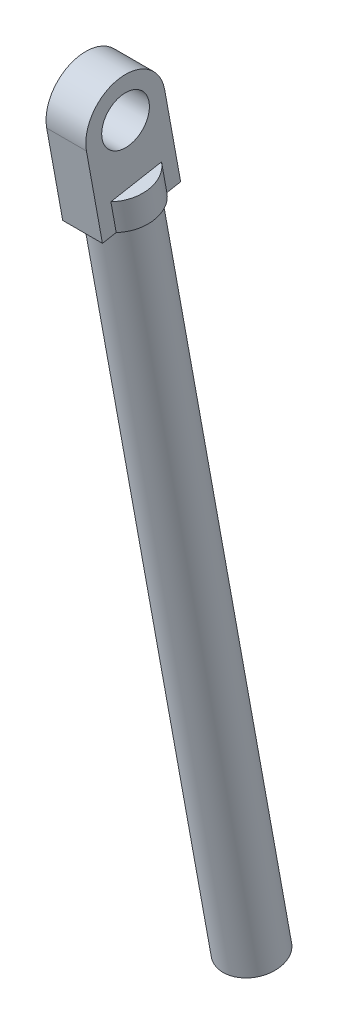
ISO-10303-21;
HEADER;
FILE_DESCRIPTION(('STEP AP214'),'2;1');
FILE_NAME('part.step','',(''),(''),'','','');
FILE_SCHEMA(('AUTOMOTIVE_DESIGN { 1 0 10303 214 1 1 1 1 }'));
ENDSEC;
DATA;
#1=APPLICATION_CONTEXT('core data for automotive mechanical design processes');
#2=APPLICATION_PROTOCOL_DEFINITION('international standard','automotive_design',2000,#1);
#3=PRODUCT_CONTEXT('',#1,'mechanical');
#4=PRODUCT('Part','Part','',(#3));
#5=PRODUCT_RELATED_PRODUCT_CATEGORY('part','',(#4));
#6=PRODUCT_DEFINITION_FORMATION('','',#4);
#7=PRODUCT_DEFINITION_CONTEXT('part definition',#1,'design');
#8=PRODUCT_DEFINITION('design','',#6,#7);
#9=PRODUCT_DEFINITION_SHAPE('','',#8);
#10=(LENGTH_UNIT() NAMED_UNIT(*) SI_UNIT(.MILLI.,.METRE.));
#11=(NAMED_UNIT(*) PLANE_ANGLE_UNIT() SI_UNIT($,.RADIAN.));
#12=(NAMED_UNIT(*) SI_UNIT($,.STERADIAN.) SOLID_ANGLE_UNIT());
#13=UNCERTAINTY_MEASURE_WITH_UNIT(LENGTH_MEASURE(1.E-05),#10,'distance_accuracy_value','');
#14=(GEOMETRIC_REPRESENTATION_CONTEXT(3) GLOBAL_UNCERTAINTY_ASSIGNED_CONTEXT((#13)) GLOBAL_UNIT_ASSIGNED_CONTEXT((#10,
#11,#12)) REPRESENTATION_CONTEXT('',''));
#15=CARTESIAN_POINT('',(0.,0.,0.));
#16=DIRECTION('',(0.,0.,1.));
#17=DIRECTION('',(1.,0.,0.));
#18=AXIS2_PLACEMENT_3D('',#15,#16,#17);
#19=CARTESIAN_POINT('',(2450.0000000001,1602.21552230463,443.812235803623));
#20=DIRECTION('',(0.,-0.983852787309741,-0.178979587950285));
#21=DIRECTION('',(-1.,0.,0.));
#22=AXIS2_PLACEMENT_3D('',#19,#20,#21);
#23=PLANE('',#22);
#24=DIRECTION('',(0.,0.178979587950285,-0.983852787309741));
#25=VECTOR('',#24,1.);
#26=CARTESIAN_POINT('',(2500.00000000005,1602.21552230463,443.812235803623));
#27=LINE('',#26,#25);
#28=CARTESIAN_POINT('',(2500.00000000005,1613.80339130362,380.113590923445));
#29=VERTEX_POINT('',#28);
#30=CARTESIAN_POINT('',(2500.00000000005,1590.62765330563,507.510880683802));
#31=VERTEX_POINT('',#30);
#32=EDGE_CURVE('E74',#29,#31,#27,.F.);
#33=ORIENTED_EDGE('',*,*,#32,.T.);
#34=CARTESIAN_POINT('',(2450.0000000001,1602.21552230463,443.812235803623));
#35=DIRECTION('',(0.,-0.983852787309741,-0.178979587950285));
#36=DIRECTION('',(-1.,0.,0.));
#37=AXIS2_PLACEMENT_3D('',#34,#35,#36);
#38=CIRCLE('',#37,81.8033988750113);
#39=EDGE_CURVE('E19',#29,#31,#38,.T.);
#40=ORIENTED_EDGE('',*,*,#39,.F.);
#41=EDGE_LOOP('',(#33,#40));
#42=FACE_BOUND('',#41,.T.);
#43=ADVANCED_FACE('F16',(#42),#23,.F.);
#44=CARTESIAN_POINT('',(2400.00000000005,1749.7934404011,470.659173996167));
#45=DIRECTION('',(-1.,0.,0.));
#46=DIRECTION('',(0.,0.983852787309741,0.178979587950285));
#47=AXIS2_PLACEMENT_3D('',#44,#45,#46);
#48=CYLINDRICAL_SURFACE('',#47,60.0000000000005);
#49=CARTESIAN_POINT('',(2400.00000000005,1749.7934404011,470.659173996167));
#50=DIRECTION('',(-1.,0.,0.));
#51=DIRECTION('',(0.,0.983852787309741,0.178979587950285));
#52=AXIS2_PLACEMENT_3D('',#49,#50,#51);
#53=CIRCLE('',#52,60.0000000000005);
#54=CARTESIAN_POINT('',(2400.00000000005,1808.82460763968,481.397949273184));
#55=VERTEX_POINT('',#54);
#56=EDGE_CURVE('E118',#55,#55,#53,.F.);
#57=ORIENTED_EDGE('',*,*,#56,.F.);
#58=EDGE_LOOP('',(#57));
#59=FACE_BOUND('',#58,.T.);
#60=CARTESIAN_POINT('',(2500.00000000005,1749.7934404011,470.659173996168));
#61=DIRECTION('',(-1.,0.,0.));
#62=DIRECTION('',(0.,0.983852787309741,0.178979587950285));
#63=AXIS2_PLACEMENT_3D('',#60,#61,#62);
#64=CIRCLE('',#63,60.0000000000005);
#65=CARTESIAN_POINT('',(2500.00000000005,1808.82460763968,481.397949273185));
#66=VERTEX_POINT('',#65);
#67=EDGE_CURVE('E77',#66,#66,#64,.F.);
#68=ORIENTED_EDGE('',*,*,#67,.T.);
#69=EDGE_LOOP('',(#68));
#70=FACE_BOUND('',#69,.T.);
#71=ADVANCED_FACE('F201',(#59,#70),#48,.F.);
#72=CARTESIAN_POINT('',(2500.00000000005,1749.7934404011,470.659173996168));
#73=DIRECTION('',(-1.,0.,0.));
#74=DIRECTION('',(0.,0.983852787309741,0.178979587950285));
#75=AXIS2_PLACEMENT_3D('',#72,#73,#74);
#76=CYLINDRICAL_SURFACE('',#75,99.9999999999996);
#77=DIRECTION('',(1.,0.,0.));
#78=VECTOR('',#77,1.);
#79=CARTESIAN_POINT('',(2500.00000000005,1767.69139919613,372.273895265193));
#80=LINE('',#79,#78);
#81=CARTESIAN_POINT('',(2400.00000000005,1767.69139919613,372.273895265192));
#82=VERTEX_POINT('',#81);
#83=CARTESIAN_POINT('',(2500.00000000005,1767.69139919613,372.273895265193));
#84=VERTEX_POINT('',#83);
#85=EDGE_CURVE('E78',#82,#84,#80,.T.);
#86=ORIENTED_EDGE('',*,*,#85,.F.);
#87=CARTESIAN_POINT('',(2400.00000000005,1749.7934404011,470.659173996167));
#88=DIRECTION('',(-1.,0.,0.));
#89=DIRECTION('',(0.,0.983852787309741,0.178979587950285));
#90=AXIS2_PLACEMENT_3D('',#87,#88,#89);
#91=CIRCLE('',#90,99.9999999999996);
#92=CARTESIAN_POINT('',(2400.00000000005,1731.89548160607,569.044452727141));
#93=VERTEX_POINT('',#92);
#94=EDGE_CURVE('E113',#93,#82,#91,.T.);
#95=ORIENTED_EDGE('',*,*,#94,.F.);
#96=DIRECTION('',(1.,0.,0.));
#97=VECTOR('',#96,1.);
#98=CARTESIAN_POINT('',(2500.00000000005,1731.89548160607,569.044452727142));
#99=LINE('',#98,#97);
#100=CARTESIAN_POINT('',(2500.00000000005,1731.89548160607,569.044452727142));
#101=VERTEX_POINT('',#100);
#102=EDGE_CURVE('E96',#101,#93,#99,.F.);
#103=ORIENTED_EDGE('',*,*,#102,.F.);
#104=CARTESIAN_POINT('',(2500.00000000005,1749.7934404011,470.659173996168));
#105=DIRECTION('',(-1.,0.,0.));
#106=DIRECTION('',(0.,0.983852787309741,0.178979587950285));
#107=AXIS2_PLACEMENT_3D('',#104,#105,#106);
#108=CIRCLE('',#107,99.9999999999996);
#109=EDGE_CURVE('E122',#101,#84,#108,.T.);
#110=ORIENTED_EDGE('',*,*,#109,.T.);
#111=EDGE_LOOP('',(#86,#95,#103,#110));
#112=FACE_BOUND('',#111,.T.);
#113=ADVANCED_FACE('F199',(#112),#76,.T.);
#114=CARTESIAN_POINT('',(2450.0000000001,1602.21552230463,443.812235803623));
#115=DIRECTION('',(0.,-0.983852787309741,-0.178979587950285));
#116=DIRECTION('',(-1.,0.,0.));
#117=AXIS2_PLACEMENT_3D('',#114,#115,#116);
#118=PLANE('',#117);
#119=DIRECTION('',(0.,0.178979587950285,-0.983852787309741));
#120=VECTOR('',#119,1.);
#121=CARTESIAN_POINT('',(2400.00000000005,1602.21552230463,443.812235803623));
#122=LINE('',#121,#120);
#123=CARTESIAN_POINT('',(2400.00000000005,1613.80339130361,380.113590923518));
#124=VERTEX_POINT('',#123);
#125=CARTESIAN_POINT('',(2400.00000000005,1590.62765330564,507.510880683728));
#126=VERTEX_POINT('',#125);
#127=EDGE_CURVE('E121',#124,#126,#122,.F.);
#128=ORIENTED_EDGE('',*,*,#127,.F.);
#129=CARTESIAN_POINT('',(2450.0000000001,1602.21552230463,443.812235803623));
#130=DIRECTION('',(0.,-0.983852787309741,-0.178979587950285));
#131=DIRECTION('',(-1.,0.,0.));
#132=AXIS2_PLACEMENT_3D('',#129,#130,#131);
#133=CIRCLE('',#132,81.8033988750117);
#134=EDGE_CURVE('E108',#126,#124,#133,.T.);
#135=ORIENTED_EDGE('',*,*,#134,.F.);
#136=EDGE_LOOP('',(#128,#135));
#137=FACE_BOUND('',#136,.T.);
#138=ADVANCED_FACE('F191',(#137),#118,.F.);
#139=CARTESIAN_POINT('',(2500.00000000005,1767.69139919613,372.273895265193));
#140=DIRECTION('',(0.,0.178979587950285,-0.983852787309741));
#141=DIRECTION('',(0.,0.983852787309741,0.178979587950285));
#142=AXIS2_PLACEMENT_3D('',#139,#140,#141);
#143=PLANE('',#142);
#144=DIRECTION('',(0.,0.983852787309741,0.178979587950285));
#145=VECTOR('',#144,1.);
#146=CARTESIAN_POINT('',(2500.00000000005,1767.69139919613,372.273895265193));
#147=LINE('',#146,#145);
#148=CARTESIAN_POINT('',(2500.00000000005,1546.32452205142,332.003487976377));
#149=VERTEX_POINT('',#148);
#150=EDGE_CURVE('E87',#84,#149,#147,.F.);
#151=ORIENTED_EDGE('',*,*,#150,.T.);
#152=DIRECTION('',(-1.,0.,0.));
#153=VECTOR('',#152,1.);
#154=CARTESIAN_POINT('',(2500.00000000005,1546.32452205142,332.003487976377));
#155=LINE('',#154,#153);
#156=CARTESIAN_POINT('',(2400.00000000005,1546.32452205142,332.003487976376));
#157=VERTEX_POINT('',#156);
#158=EDGE_CURVE('E131',#157,#149,#155,.F.);
#159=ORIENTED_EDGE('',*,*,#158,.F.);
#160=DIRECTION('',(0.,0.983852787309741,0.178979587950285));
#161=VECTOR('',#160,1.);
#162=CARTESIAN_POINT('',(2400.00000000005,1767.69139919613,372.273895265192));
#163=LINE('',#162,#161);
#164=EDGE_CURVE('E116',#82,#157,#163,.F.);
#165=ORIENTED_EDGE('',*,*,#164,.F.);
#166=ORIENTED_EDGE('',*,*,#85,.T.);
#167=EDGE_LOOP('',(#151,#159,#165,#166));
#168=FACE_BOUND('',#167,.T.);
#169=ADVANCED_FACE('F143',(#168),#143,.T.);
#170=CARTESIAN_POINT('',(2450.0000000001,1602.21552230463,443.812235803623));
#171=DIRECTION('',(0.,-0.983852787309741,-0.178979587950285));
#172=DIRECTION('',(-1.,0.,0.));
#173=AXIS2_PLACEMENT_3D('',#170,#171,#172);
#174=CYLINDRICAL_SURFACE('',#173,81.8033988750113);
#175=ORIENTED_EDGE('',*,*,#39,.T.);
#176=DIRECTION('',(0.,0.983852787309741,0.178979587950285));
#177=VECTOR('',#176,1.);
#178=CARTESIAN_POINT('',(2500.00000000005,1738.2055714021,534.357818876346));
#179=LINE('',#178,#177);
#180=CARTESIAN_POINT('',(2500.00000000005,1516.8386942574,494.08741158753));
#181=VERTEX_POINT('',#180);
#182=EDGE_CURVE('E92',#31,#181,#179,.F.);
#183=ORIENTED_EDGE('',*,*,#182,.T.);
#184=CARTESIAN_POINT('',(2450.0000000001,1528.42656325639,430.388766707352));
#185=DIRECTION('',(0.,-0.983852787309741,-0.178979587950285));
#186=DIRECTION('',(-1.,0.,0.));
#187=AXIS2_PLACEMENT_3D('',#184,#185,#186);
#188=CIRCLE('',#187,81.8033988750113);
#189=CARTESIAN_POINT('',(2500.00000000005,1540.01443225539,366.690121827173));
#190=VERTEX_POINT('',#189);
#191=EDGE_CURVE('E83',#190,#181,#188,.T.);
#192=ORIENTED_EDGE('',*,*,#191,.F.);
#193=DIRECTION('',(0.,0.983852787309741,0.178979587950285));
#194=VECTOR('',#193,1.);
#195=CARTESIAN_POINT('',(2500.00000000005,1761.3813094001,406.960529115989));
#196=LINE('',#195,#194);
#197=EDGE_CURVE('E80',#190,#29,#196,.T.);
#198=ORIENTED_EDGE('',*,*,#197,.T.);
#199=EDGE_LOOP('',(#175,#183,#192,#198));
#200=FACE_BOUND('',#199,.T.);
#201=ADVANCED_FACE('F81',(#200),#174,.T.);
#202=CARTESIAN_POINT('',(2500.00000000005,1749.7934404011,470.659173996168));
#203=DIRECTION('',(-1.,0.,0.));
#204=DIRECTION('',(0.,0.983852787309741,0.178979587950285));
#205=AXIS2_PLACEMENT_3D('',#202,#203,#204);
#206=PLANE('',#205);
#207=ORIENTED_EDGE('',*,*,#197,.F.);
#208=DIRECTION('',(0.,0.178979587950285,-0.983852787309741));
#209=VECTOR('',#208,1.);
#210=CARTESIAN_POINT('',(2500.00000000005,1546.32452205142,332.003487976377));
#211=LINE('',#210,#209);
#212=EDGE_CURVE('E107',#149,#190,#211,.F.);
#213=ORIENTED_EDGE('',*,*,#212,.F.);
#214=ORIENTED_EDGE('',*,*,#150,.F.);
#215=ORIENTED_EDGE('',*,*,#109,.F.);
#216=DIRECTION('',(0.,-0.983852787309741,-0.178979587950285));
#217=VECTOR('',#216,1.);
#218=CARTESIAN_POINT('',(2500.00000000005,1510.52860446137,528.774045438326));
#219=LINE('',#218,#217);
#220=CARTESIAN_POINT('',(2500.00000000005,1510.52860446137,528.774045438326));
#221=VERTEX_POINT('',#220);
#222=EDGE_CURVE('E93',#221,#101,#219,.F.);
#223=ORIENTED_EDGE('',*,*,#222,.F.);
#224=DIRECTION('',(0.,0.178979587950285,-0.983852787309741));
#225=VECTOR('',#224,1.);
#226=CARTESIAN_POINT('',(2500.00000000005,1546.32452205142,332.003487976377));
#227=LINE('',#226,#225);
#228=EDGE_CURVE('E106',#181,#221,#227,.F.);
#229=ORIENTED_EDGE('',*,*,#228,.F.);
#230=ORIENTED_EDGE('',*,*,#182,.F.);
#231=ORIENTED_EDGE('',*,*,#32,.F.);
#232=EDGE_LOOP('',(#207,#213,#214,#215,#223,#229,#230,#231));
#233=FACE_BOUND('',#232,.T.);
#234=ORIENTED_EDGE('',*,*,#67,.F.);
#235=EDGE_LOOP('',(#234));
#236=FACE_BOUND('',#235,.T.);
#237=ADVANCED_FACE('F89',(#233,#236),#206,.F.);
#238=CARTESIAN_POINT('',(2500.00000000005,1510.52860446137,528.774045438326));
#239=DIRECTION('',(0.,-0.178979587950285,0.983852787309741));
#240=DIRECTION('',(0.,-0.983852787309741,-0.178979587950285));
#241=AXIS2_PLACEMENT_3D('',#238,#239,#240);
#242=PLANE('',#241);
#243=ORIENTED_EDGE('',*,*,#222,.T.);
#244=ORIENTED_EDGE('',*,*,#102,.T.);
#245=DIRECTION('',(0.,0.983852787309741,0.178979587950285));
#246=VECTOR('',#245,1.);
#247=CARTESIAN_POINT('',(2400.00000000005,1731.89548160607,569.044452727141));
#248=LINE('',#247,#246);
#249=CARTESIAN_POINT('',(2400.00000000005,1510.52860446137,528.774045438325));
#250=VERTEX_POINT('',#249);
#251=EDGE_CURVE('E117',#250,#93,#248,.T.);
#252=ORIENTED_EDGE('',*,*,#251,.F.);
#253=DIRECTION('',(-1.,0.,0.));
#254=VECTOR('',#253,1.);
#255=CARTESIAN_POINT('',(2500.00000000005,1510.52860446137,528.774045438326));
#256=LINE('',#255,#254);
#257=EDGE_CURVE('E154',#221,#250,#256,.T.);
#258=ORIENTED_EDGE('',*,*,#257,.F.);
#259=EDGE_LOOP('',(#243,#244,#252,#258));
#260=FACE_BOUND('',#259,.T.);
#261=ADVANCED_FACE('F198',(#260),#242,.T.);
#262=CARTESIAN_POINT('',(2400.00000000005,1749.7934404011,470.659173996167));
#263=DIRECTION('',(-1.,0.,0.));
#264=DIRECTION('',(0.,0.983852787309741,0.178979587950285));
#265=AXIS2_PLACEMENT_3D('',#262,#263,#264);
#266=PLANE('',#265);
#267=ORIENTED_EDGE('',*,*,#164,.T.);
#268=DIRECTION('',(0.,0.178979587950285,-0.983852787309741));
#269=VECTOR('',#268,1.);
#270=CARTESIAN_POINT('',(2400.00000000005,1546.32452205142,332.003487976376));
#271=LINE('',#270,#269);
#272=CARTESIAN_POINT('',(2400.00000000005,1540.01443225538,366.690121827247));
#273=VERTEX_POINT('',#272);
#274=EDGE_CURVE('E134',#273,#157,#271,.T.);
#275=ORIENTED_EDGE('',*,*,#274,.F.);
#276=DIRECTION('',(0.,-0.983852787309741,-0.178979587950285));
#277=VECTOR('',#276,1.);
#278=CARTESIAN_POINT('',(2400.00000000005,1613.80339130361,380.113590923519));
#279=LINE('',#278,#277);
#280=EDGE_CURVE('E111',#124,#273,#279,.T.);
#281=ORIENTED_EDGE('',*,*,#280,.F.);
#282=ORIENTED_EDGE('',*,*,#127,.T.);
#283=DIRECTION('',(0.,-0.983852787309741,-0.178979587950285));
#284=VECTOR('',#283,1.);
#285=CARTESIAN_POINT('',(2400.00000000005,1590.62765330564,507.510880683728));
#286=LINE('',#285,#284);
#287=CARTESIAN_POINT('',(2400.00000000005,1516.83869425741,494.087411587457));
#288=VERTEX_POINT('',#287);
#289=EDGE_CURVE('E112',#288,#126,#286,.F.);
#290=ORIENTED_EDGE('',*,*,#289,.F.);
#291=DIRECTION('',(0.,0.178979587950285,-0.983852787309741));
#292=VECTOR('',#291,1.);
#293=CARTESIAN_POINT('',(2400.00000000005,1546.32452205142,332.003487976376));
#294=LINE('',#293,#292);
#295=EDGE_CURVE('E104',#250,#288,#294,.T.);
#296=ORIENTED_EDGE('',*,*,#295,.F.);
#297=ORIENTED_EDGE('',*,*,#251,.T.);
#298=ORIENTED_EDGE('',*,*,#94,.T.);
#299=EDGE_LOOP('',(#267,#275,#281,#282,#290,#296,#297,#298));
#300=FACE_BOUND('',#299,.T.);
#301=ORIENTED_EDGE('',*,*,#56,.T.);
#302=EDGE_LOOP('',(#301));
#303=FACE_BOUND('',#302,.T.);
#304=ADVANCED_FACE('F186',(#300,#303),#266,.T.);
#305=CARTESIAN_POINT('',(2450.0000000001,1602.21552230463,443.812235803623));
#306=DIRECTION('',(0.,-0.983852787309741,-0.178979587950285));
#307=DIRECTION('',(-1.,0.,0.));
#308=AXIS2_PLACEMENT_3D('',#305,#306,#307);
#309=CYLINDRICAL_SURFACE('',#308,81.8033988750117);
#310=ORIENTED_EDGE('',*,*,#280,.T.);
#311=CARTESIAN_POINT('',(2450.0000000001,1528.42656325639,430.388766707352));
#312=DIRECTION('',(0.,-0.983852787309741,-0.178979587950285));
#313=DIRECTION('',(-1.,0.,0.));
#314=AXIS2_PLACEMENT_3D('',#311,#312,#313);
#315=CIRCLE('',#314,81.8033988750117);
#316=EDGE_CURVE('E34',#288,#273,#315,.T.);
#317=ORIENTED_EDGE('',*,*,#316,.F.);
#318=ORIENTED_EDGE('',*,*,#289,.T.);
#319=ORIENTED_EDGE('',*,*,#134,.T.);
#320=EDGE_LOOP('',(#310,#317,#318,#319));
#321=FACE_BOUND('',#320,.T.);
#322=ADVANCED_FACE('F189',(#321),#309,.T.);
#323=CARTESIAN_POINT('',(2522.5000000001,-267.104773583882,103.751018698081));
#324=DIRECTION('',(0.,-0.983852787309741,-0.178979587950285));
#325=DIRECTION('',(-1.,0.,0.));
#326=AXIS2_PLACEMENT_3D('',#323,#324,#325);
#327=PLANE('',#326);
#328=CARTESIAN_POINT('',(2450.0000000001,-267.104773583882,103.751018698081));
#329=DIRECTION('',(0.,0.983852787309741,0.178979587950285));
#330=DIRECTION('',(1.,0.,0.));
#331=AXIS2_PLACEMENT_3D('',#328,#329,#330);
#332=CIRCLE('',#331,72.5);
#333=CARTESIAN_POINT('',(2522.5000000001,-267.104773583882,103.751018698081));
#334=VERTEX_POINT('',#333);
#335=EDGE_CURVE('E25',#334,#334,#332,.T.);
#336=ORIENTED_EDGE('',*,*,#335,.F.);
#337=EDGE_LOOP('',(#336));
#338=FACE_BOUND('',#337,.T.);
#339=ADVANCED_FACE('F217',(#338),#327,.T.);
#340=CARTESIAN_POINT('',(2500.00000000005,1546.32452205142,332.003487976377));
#341=DIRECTION('',(0.,-0.983852787309741,-0.178979587950285));
#342=DIRECTION('',(-1.,0.,0.));
#343=AXIS2_PLACEMENT_3D('',#340,#341,#342);
#344=PLANE('',#343);
#345=ORIENTED_EDGE('',*,*,#295,.T.);
#346=ORIENTED_EDGE('',*,*,#316,.T.);
#347=ORIENTED_EDGE('',*,*,#274,.T.);
#348=ORIENTED_EDGE('',*,*,#158,.T.);
#349=ORIENTED_EDGE('',*,*,#212,.T.);
#350=ORIENTED_EDGE('',*,*,#191,.T.);
#351=ORIENTED_EDGE('',*,*,#228,.T.);
#352=ORIENTED_EDGE('',*,*,#257,.T.);
#353=EDGE_LOOP('',(#345,#346,#347,#348,#349,#350,#351,#352));
#354=FACE_BOUND('',#353,.T.);
#355=CARTESIAN_POINT('',(2450.0000000001,1528.42656325639,430.388766707351));
#356=DIRECTION('',(0.,0.983852787309741,0.178979587950285));
#357=DIRECTION('',(1.,0.,0.));
#358=AXIS2_PLACEMENT_3D('',#355,#356,#357);
#359=CIRCLE('',#358,72.5);
#360=CARTESIAN_POINT('',(2522.5000000001,1528.42656325639,430.388766707351));
#361=VERTEX_POINT('',#360);
#362=EDGE_CURVE('E10',#361,#361,#359,.F.);
#363=ORIENTED_EDGE('',*,*,#362,.F.);
#364=EDGE_LOOP('',(#363));
#365=FACE_BOUND('',#364,.T.);
#366=ADVANCED_FACE('F182',(#354,#365),#344,.T.);
#367=CARTESIAN_POINT('',(2450.0000000001,-267.104773583882,103.751018698081));
#368=DIRECTION('',(0.,0.983852787309741,0.178979587950285));
#369=DIRECTION('',(1.,0.,0.));
#370=AXIS2_PLACEMENT_3D('',#367,#368,#369);
#371=CYLINDRICAL_SURFACE('',#370,72.5);
#372=ORIENTED_EDGE('',*,*,#362,.T.);
#373=EDGE_LOOP('',(#372));
#374=FACE_BOUND('',#373,.T.);
#375=ORIENTED_EDGE('',*,*,#335,.T.);
#376=EDGE_LOOP('',(#375));
#377=FACE_BOUND('',#376,.T.);
#378=ADVANCED_FACE('F210',(#374,#377),#371,.T.);
#379=CLOSED_SHELL('',(#43,#71,#113,#138,#169,#201,#237,#261,#304,#322,#339,#366,#378));
#380=MANIFOLD_SOLID_BREP('B1',#379);
#381=ADVANCED_BREP_SHAPE_REPRESENTATION('',(#18,#380),#14);
#382=SHAPE_DEFINITION_REPRESENTATION(#9,#381);
ENDSEC;
END-ISO-10303-21;
